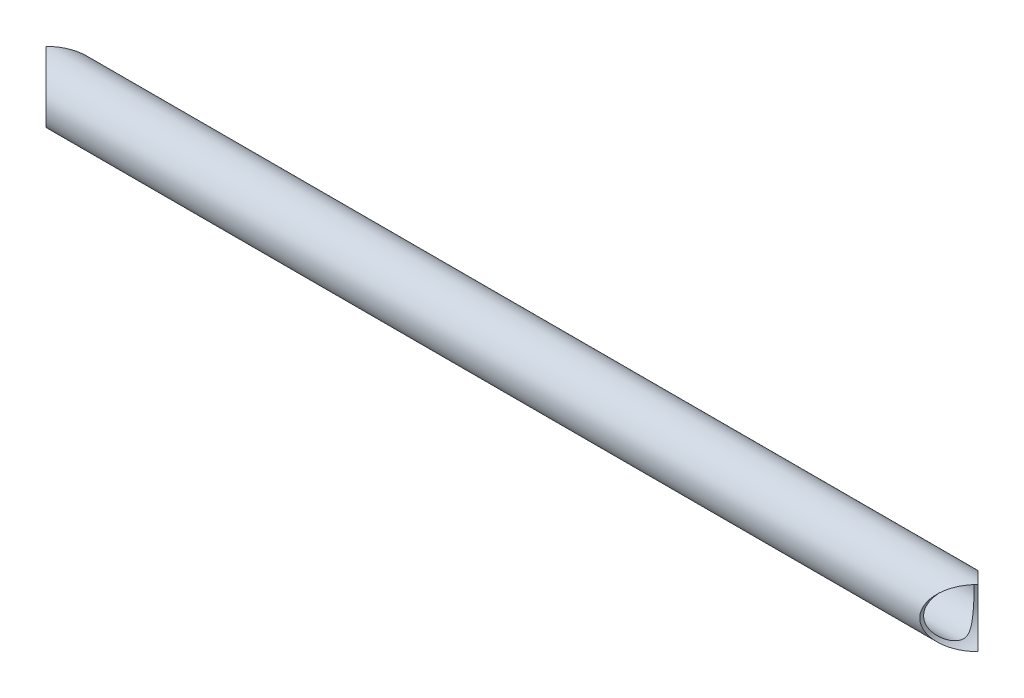
ISO-10303-21;
HEADER;
FILE_DESCRIPTION(('STEP AP214'),'2;1');
FILE_NAME('part.step','',(''),(''),'','','');
FILE_SCHEMA(('AUTOMOTIVE_DESIGN { 1 0 10303 214 1 1 1 1 }'));
ENDSEC;
DATA;
#1=APPLICATION_CONTEXT('core data for automotive mechanical design processes');
#2=APPLICATION_PROTOCOL_DEFINITION('international standard','automotive_design',2000,#1);
#3=PRODUCT_CONTEXT('',#1,'mechanical');
#4=PRODUCT('Part','Part','',(#3));
#5=PRODUCT_RELATED_PRODUCT_CATEGORY('part','',(#4));
#6=PRODUCT_DEFINITION_FORMATION('','',#4);
#7=PRODUCT_DEFINITION_CONTEXT('part definition',#1,'design');
#8=PRODUCT_DEFINITION('design','',#6,#7);
#9=PRODUCT_DEFINITION_SHAPE('','',#8);
#10=(LENGTH_UNIT() NAMED_UNIT(*) SI_UNIT(.MILLI.,.METRE.));
#11=(NAMED_UNIT(*) PLANE_ANGLE_UNIT() SI_UNIT($,.RADIAN.));
#12=(NAMED_UNIT(*) SI_UNIT($,.STERADIAN.) SOLID_ANGLE_UNIT());
#13=UNCERTAINTY_MEASURE_WITH_UNIT(LENGTH_MEASURE(1.E-05),#10,'distance_accuracy_value','');
#14=(GEOMETRIC_REPRESENTATION_CONTEXT(3) GLOBAL_UNCERTAINTY_ASSIGNED_CONTEXT((#13)) GLOBAL_UNIT_ASSIGNED_CONTEXT((#10,
#11,#12)) REPRESENTATION_CONTEXT('',''));
#15=CARTESIAN_POINT('',(0.,0.,0.));
#16=DIRECTION('',(0.,0.,1.));
#17=DIRECTION('',(1.,0.,0.));
#18=AXIS2_PLACEMENT_3D('',#15,#16,#17);
#19=CARTESIAN_POINT('',(-152.4,228.6,-238.125));
#20=DIRECTION('',(0.,0.,1.));
#21=DIRECTION('',(1.,0.,0.));
#22=AXIS2_PLACEMENT_3D('',#19,#20,#21);
#23=CYLINDRICAL_SURFACE('',#22,9.52499999999999);
#24=CARTESIAN_POINT('',(-152.4,228.6,-101.6));
#25=DIRECTION('',(0.707106781186547,0.,0.707106781186547));
#26=DIRECTION('',(0.707106781186547,0.,-0.707106781186547));
#27=AXIS2_PLACEMENT_3D('',#24,#25,#26);
#28=ELLIPSE('',#27,13.4703841816037,9.525);
#29=CARTESIAN_POINT('',(-152.4,238.125,-101.6));
#30=VERTEX_POINT('',#29);
#31=CARTESIAN_POINT('',(-152.4,219.075,-101.6));
#32=VERTEX_POINT('',#31);
#33=EDGE_CURVE('E47',#30,#32,#28,.F.);
#34=ORIENTED_EDGE('',*,*,#33,.T.);
#35=CARTESIAN_POINT('',(-152.4,228.6,-101.6));
#36=DIRECTION('',(0.707106781186547,0.,-0.707106781186547));
#37=DIRECTION('',(0.707106781186547,0.,0.707106781186547));
#38=AXIS2_PLACEMENT_3D('',#35,#36,#37);
#39=ELLIPSE('',#38,13.4703841816037,9.525);
#40=EDGE_CURVE('E57',#32,#30,#39,.F.);
#41=ORIENTED_EDGE('',*,*,#40,.T.);
#42=EDGE_LOOP('',(#34,#41));
#43=FACE_BOUND('',#42,.T.);
#44=CARTESIAN_POINT('',(-142.875,228.6,-109.855));
#45=CARTESIAN_POINT('',(-142.87500085137,228.406250866017,-109.854999130974));
#46=CARTESIAN_POINT('',(-142.880923976125,228.212489304632,-109.848166780821));
#47=CARTESIAN_POINT('',(-142.904480069302,227.826631422453,-109.820969787789));
#48=CARTESIAN_POINT('',(-142.922114069863,227.634535249952,-109.800603952137));
#49=CARTESIAN_POINT('',(-142.968700531082,227.253494245892,-109.74671669801));
#50=CARTESIAN_POINT('',(-142.997658993398,227.064551140828,-109.7131883037));
#51=CARTESIAN_POINT('',(-143.06626573945,226.691325809148,-109.633579683001));
#52=CARTESIAN_POINT('',(-143.105914030754,226.507043585832,-109.587499447726));
#53=CARTESIAN_POINT('',(-143.194816129542,226.145482745751,-109.483876820132));
#54=CARTESIAN_POINT('',(-143.244006461934,225.968166681786,-109.42641012091));
#55=CARTESIAN_POINT('',(-143.351288626491,225.620129557817,-109.300626973059));
#56=CARTESIAN_POINT('',(-143.409384351749,225.44941142324,-109.232305778788));
#57=CARTESIAN_POINT('',(-143.533513866231,225.115348117664,-109.08568628537));
#58=CARTESIAN_POINT('',(-143.599546793716,224.952002148917,-109.007389069259));
#59=CARTESIAN_POINT('',(-143.738608516535,224.633112425986,-108.841625230969));
#60=CARTESIAN_POINT('',(-143.811638843562,224.477570391447,-108.75415660082));
#61=CARTESIAN_POINT('',(-143.992942230831,224.116475044909,-108.535636063504));
#62=CARTESIAN_POINT('',(-144.103987372303,223.91462757172,-108.400737315239));
#63=CARTESIAN_POINT('',(-144.335256151997,223.526881378591,-108.116617995095));
#64=CARTESIAN_POINT('',(-144.455483046478,223.340988366918,-107.967392337387));
#65=CARTESIAN_POINT('',(-144.703057246966,222.984857023593,-107.655685455599));
#66=CARTESIAN_POINT('',(-144.83042068778,222.814656672967,-107.493173779029));
#67=CARTESIAN_POINT('',(-145.089672364822,222.490349874275,-107.156246763394));
#68=CARTESIAN_POINT('',(-145.221559996968,222.336241288616,-106.981833010476));
#69=CARTESIAN_POINT('',(-145.490268739031,222.040890582044,-106.617887041554));
#70=CARTESIAN_POINT('',(-145.627135289796,221.899986610464,-106.428114257642));
#71=CARTESIAN_POINT('',(-145.900277029826,221.634695381101,-106.036829549169));
#72=CARTESIAN_POINT('',(-146.036552013629,221.510313477172,-105.83531384969));
#73=CARTESIAN_POINT('',(-146.304688635106,221.278516699451,-105.420633298704));
#74=CARTESIAN_POINT('',(-146.436558723786,221.171067666948,-105.207493098286));
#75=CARTESIAN_POINT('',(-146.691442369474,220.973470149248,-104.768431819703));
#76=CARTESIAN_POINT('',(-146.81446287908,220.883307987932,-104.542521029458));
#77=CARTESIAN_POINT('',(-147.050125579428,220.717996418519,-104.066814429983));
#78=CARTESIAN_POINT('',(-147.162117857019,220.643633336703,-103.816414669167));
#79=CARTESIAN_POINT('',(-147.358880568049,220.517519256837,-103.299638917286));
#80=CARTESIAN_POINT('',(-147.443709065653,220.465719940797,-103.033298467592));
#81=CARTESIAN_POINT('',(-147.536097566616,220.410426737364,-102.643940845343));
#82=CARTESIAN_POINT('',(-147.560081572859,220.396260607156,-102.526240140689));
#83=CARTESIAN_POINT('',(-147.599826557136,220.372941215349,-102.288990887447));
#84=CARTESIAN_POINT('',(-147.615591423194,220.363785583455,-102.169443240154));
#85=CARTESIAN_POINT('',(-147.638195926769,220.350695800613,-101.929320339337));
#86=CARTESIAN_POINT('',(-147.645043337139,220.346757102303,-101.808746073072));
#87=CARTESIAN_POINT('',(-147.649515298126,220.344182219285,-101.567366153929));
#88=CARTESIAN_POINT('',(-147.647139751201,220.345546090658,-101.446560498618));
#89=CARTESIAN_POINT('',(-147.633287188579,220.353537911924,-101.205834453977));
#90=CARTESIAN_POINT('',(-147.621823920942,220.360157910279,-101.085913003378));
#91=CARTESIAN_POINT('',(-147.590347526087,220.378492094755,-100.847573528745));
#92=CARTESIAN_POINT('',(-147.570330763999,220.390208446644,-100.72915616594));
#93=CARTESIAN_POINT('',(-147.498589799333,220.432691819621,-100.376893975858));
#94=CARTESIAN_POINT('',(-147.435188530354,220.47078599086,-100.146237071126));
#95=CARTESIAN_POINT('',(-147.298694955178,220.555900672935,-99.7362927241506));
#96=CARTESIAN_POINT('',(-147.229283916365,220.60016196055,-99.5551200338247));
#97=CARTESIAN_POINT('',(-147.079042683176,220.699294360388,-99.2004665430093));
#98=CARTESIAN_POINT('',(-146.998204624502,220.754172789204,-99.0269911488941));
#99=CARTESIAN_POINT('',(-146.828240047895,220.87394281657,-98.6869795992413));
#100=CARTESIAN_POINT('',(-146.739085754094,220.938868485421,-98.5204695993091));
#101=CARTESIAN_POINT('',(-146.555384272125,221.078072533404,-98.1945616282065));
#102=CARTESIAN_POINT('',(-146.460837695236,221.152349853565,-98.035162854532));
#103=CARTESIAN_POINT('',(-146.217533604388,221.351633994807,-97.6404902495467));
#104=CARTESIAN_POINT('',(-146.066534072351,221.482704521305,-97.4096393817731));
#105=CARTESIAN_POINT('',(-145.762225101465,221.765614163585,-96.962524617294));
#106=CARTESIAN_POINT('',(-145.608914543225,221.917463651808,-96.746268086802));
#107=CARTESIAN_POINT('',(-145.304431641632,222.241702561116,-96.3286761462399));
#108=CARTESIAN_POINT('',(-145.153256847605,222.414065861768,-96.127322279545));
#109=CARTESIAN_POINT('',(-144.856523823392,222.779606131111,-95.7400616136068));
#110=CARTESIAN_POINT('',(-144.710963114576,222.972773768413,-95.5541479546798));
#111=CARTESIAN_POINT('',(-144.462698797748,223.33119127101,-95.2417910636064));
#112=CARTESIAN_POINT('',(-144.358090176679,223.492023598625,-95.1117795826543));
#113=CARTESIAN_POINT('',(-144.155601927927,223.825736010478,-94.8624340565053));
#114=CARTESIAN_POINT('',(-144.057720826399,223.998613439092,-94.7430976709017));
#115=CARTESIAN_POINT('',(-143.870359334607,224.356002397327,-94.5163399634888));
#116=CARTESIAN_POINT('',(-143.780868875253,224.540499526382,-94.4089043314715));
#117=CARTESIAN_POINT('',(-143.611787868989,224.920837747688,-94.2070907582165));
#118=CARTESIAN_POINT('',(-143.532195476047,225.116676714618,-94.1127103817458));
#119=CARTESIAN_POINT('',(-143.397688658435,225.483103214577,-93.9539254727978));
#120=CARTESIAN_POINT('',(-143.340902606584,225.651989745095,-93.8871748412764));
#121=CARTESIAN_POINT('',(-143.236041203049,225.996188653914,-93.7642761294147));
#122=CARTESIAN_POINT('',(-143.187964032091,226.171499680925,-93.7081258345755));
#123=CARTESIAN_POINT('',(-143.10137378059,226.527624248783,-93.6072207343836));
#124=CARTESIAN_POINT('',(-143.062857419736,226.708435878407,-93.5624620204508));
#125=CARTESIAN_POINT('',(-142.99611185728,227.074508745958,-93.4850201399113));
#126=CARTESIAN_POINT('',(-142.967882768004,227.259770032446,-93.4523371051585));
#127=CARTESIAN_POINT('',(-142.922193476377,227.634306222712,-93.3994881817187));
#128=CARTESIAN_POINT('',(-142.904785183164,227.823596035695,-93.3793826263627));
#129=CARTESIAN_POINT('',(-142.881337103709,228.20381950668,-93.352310062631));
#130=CARTESIAN_POINT('',(-142.875297343065,228.394753168384,-93.345343083839));
#131=CARTESIAN_POINT('',(-142.87472412799,228.776645314771,-93.3446816904598));
#132=CARTESIAN_POINT('',(-142.880189796571,228.967603796453,-93.3509862642653));
#133=CARTESIAN_POINT('',(-142.902501380858,229.347952184751,-93.3767450743445));
#134=CARTESIAN_POINT('',(-142.91934681187,229.537342157826,-93.396198750563));
#135=CARTESIAN_POINT('',(-142.962336192805,229.898723012674,-93.4459187722398));
#136=CARTESIAN_POINT('',(-142.987674409474,230.070940627884,-93.4752489624016));
#137=CARTESIAN_POINT('',(-143.047291157423,230.411738571797,-93.544388950317));
#138=CARTESIAN_POINT('',(-143.08157267569,230.580317664858,-93.5842022493825));
#139=CARTESIAN_POINT('',(-143.158481542436,230.912806206632,-93.673740561271));
#140=CARTESIAN_POINT('',(-143.201106417521,231.076717022802,-93.7234626367097));
#141=CARTESIAN_POINT('',(-143.294060632431,231.399227506909,-93.8322249997312));
#142=CARTESIAN_POINT('',(-143.344392844517,231.557825167848,-93.8912687614435));
#143=CARTESIAN_POINT('',(-143.456253247045,231.881239112751,-94.022974848676));
#144=CARTESIAN_POINT('',(-143.518349023612,232.045572644807,-94.096340886794));
#145=CARTESIAN_POINT('',(-143.64974919785,232.366815288716,-94.2523440091093));
#146=CARTESIAN_POINT('',(-143.719056432078,232.523721443506,-94.3349847424298));
#147=CARTESIAN_POINT('',(-143.936469748638,232.982783680093,-94.5957141072836));
#148=CARTESIAN_POINT('',(-144.094085643406,233.273334821802,-94.7866311500132));
#149=CARTESIAN_POINT('',(-144.386795384043,233.754931306402,-95.1471672195281));
#150=CARTESIAN_POINT('',(-144.518072006197,233.95301288062,-95.3107106505702));
#151=CARTESIAN_POINT('',(-144.788096265142,234.330473861314,-95.6526059082699));
#152=CARTESIAN_POINT('',(-144.926844378882,234.509852071695,-95.8309586806876));
#153=CARTESIAN_POINT('',(-145.209205633139,234.850372890798,-96.201721613324));
#154=CARTESIAN_POINT('',(-145.352829852161,235.011469781996,-96.3941651184609));
#155=CARTESIAN_POINT('',(-145.641483857342,235.315050172218,-96.7921155975218));
#156=CARTESIAN_POINT('',(-145.786513199098,235.457539362408,-96.9976185484917));
#157=CARTESIAN_POINT('',(-146.044840743108,235.696611503452,-97.3782997784627));
#158=CARTESIAN_POINT('',(-146.158549640075,235.796617427103,-97.5510596552251));
#159=CARTESIAN_POINT('',(-146.382312464771,235.984741839882,-97.9052937918285));
#160=CARTESIAN_POINT('',(-146.492365718185,236.072858144948,-98.0867696444704));
#161=CARTESIAN_POINT('',(-146.705590868976,236.236578933631,-98.4585319022405));
#162=CARTESIAN_POINT('',(-146.80877963104,236.312214812114,-98.6487946098));
#163=CARTESIAN_POINT('',(-147.004599732918,236.450454207426,-99.039088469596));
#164=CARTESIAN_POINT('',(-147.097238506192,236.513066926325,-99.2391126002503));
#165=CARTESIAN_POINT('',(-147.280539028389,236.633093878315,-99.6828989038143));
#166=CARTESIAN_POINT('',(-147.368486554437,236.688052450932,-99.9285215602658));
#167=CARTESIAN_POINT('',(-147.476624086336,236.754004837994,-100.306339204585));
#168=CARTESIAN_POINT('',(-147.508691291353,236.773233391453,-100.43374642192));
#169=CARTESIAN_POINT('',(-147.56361192475,236.805851299184,-100.691239187818));
#170=CARTESIAN_POINT('',(-147.586470306333,236.819243792849,-100.821323256882));
#171=CARTESIAN_POINT('',(-147.62206810894,236.839989631339,-101.084946705684));
#172=CARTESIAN_POINT('',(-147.634684394664,236.84726952223,-101.218508764674));
#173=CARTESIAN_POINT('',(-147.648619874186,236.855306107447,-101.486417919941));
#174=CARTESIAN_POINT('',(-147.649939911573,236.85606328888,-101.620764956847));
#175=CARTESIAN_POINT('',(-147.641202324923,236.851029854125,-101.889034938598));
#176=CARTESIAN_POINT('',(-147.631138307579,236.845235558614,-102.02295760274));
#177=CARTESIAN_POINT('',(-147.600209848149,236.827268862574,-102.289111683742));
#178=CARTESIAN_POINT('',(-147.579343623203,236.815095409186,-102.421342817729));
#179=CARTESIAN_POINT('',(-147.523697580561,236.782206595522,-102.704546430064));
#180=CARTESIAN_POINT('',(-147.487202723969,236.760421364586,-102.855055287897));
#181=CARTESIAN_POINT('',(-147.403191155665,236.709250007172,-103.151703252687));
#182=CARTESIAN_POINT('',(-147.355665479551,236.67985769641,-103.297838695869));
#183=CARTESIAN_POINT('',(-147.251644772577,236.613978878295,-103.585709123146));
#184=CARTESIAN_POINT('',(-147.19512334772,236.577471421659,-103.727429643092));
#185=CARTESIAN_POINT('',(-147.07520407736,236.497933942537,-104.005958110791));
#186=CARTESIAN_POINT('',(-147.011807777588,236.454905385378,-104.142767153659));
#187=CARTESIAN_POINT('',(-146.832749866028,236.329831049898,-104.507591185681));
#188=CARTESIAN_POINT('',(-146.712045295214,236.241836566895,-104.731104258484));
#189=CARTESIAN_POINT('',(-146.461768069578,236.049031016719,-105.165597586059));
#190=CARTESIAN_POINT('',(-146.332189369989,235.944208420122,-105.376569111478));
#191=CARTESIAN_POINT('',(-146.068538777804,235.718175810107,-105.7870696561));
#192=CARTESIAN_POINT('',(-145.934460864055,235.596943119533,-105.98658228698));
#193=CARTESIAN_POINT('',(-145.665453567415,235.338421490995,-106.374196011052));
#194=CARTESIAN_POINT('',(-145.530524401609,235.201136501598,-106.562299893368));
#195=CARTESIAN_POINT('',(-145.254370347392,234.901555904191,-106.938225874476));
#196=CARTESIAN_POINT('',(-145.113264475866,234.738244688045,-107.125328601192));
#197=CARTESIAN_POINT('',(-144.836105671408,234.39328048647,-107.48601693765));
#198=CARTESIAN_POINT('',(-144.70005372929,234.211623930162,-107.65959990411));
#199=CARTESIAN_POINT('',(-144.436140711227,233.830317575679,-107.99160103031));
#200=CARTESIAN_POINT('',(-144.30826219629,233.63070843393,-108.150051859642));
#201=CARTESIAN_POINT('',(-144.063250623786,233.21332127486,-108.450425409072));
#202=CARTESIAN_POINT('',(-143.946112658529,232.995551643368,-108.592355685993));
#203=CARTESIAN_POINT('',(-143.757591966555,232.608288566503,-108.818956087031));
#204=CARTESIAN_POINT('',(-143.682805017896,232.443156845253,-108.90828007273));
#205=CARTESIAN_POINT('',(-143.54120930788,232.104443279242,-109.07660654907));
#206=CARTESIAN_POINT('',(-143.474398582611,231.930863529438,-109.155611580905));
#207=CARTESIAN_POINT('',(-143.349896757306,231.576001146484,-109.302289914397));
#208=CARTESIAN_POINT('',(-143.292197695421,231.394725415898,-109.369973112269));
#209=CARTESIAN_POINT('',(-143.186917126928,231.025204306969,-109.493118335221));
#210=CARTESIAN_POINT('',(-143.139334511082,230.836959695404,-109.548581700195));
#211=CARTESIAN_POINT('',(-143.061127906438,230.481346233512,-109.639551741935));
#212=CARTESIAN_POINT('',(-143.029064178173,230.314728334993,-109.676763022143));
#213=CARTESIAN_POINT('',(-142.973668033218,229.978041246021,-109.740970368102));
#214=CARTESIAN_POINT('',(-142.950338057636,229.807971104638,-109.767963577899));
#215=CARTESIAN_POINT('',(-142.912838905101,229.465488145167,-109.811318052968));
#216=CARTESIAN_POINT('',(-142.89866900201,229.293075513879,-109.82768016099));
#217=CARTESIAN_POINT('',(-142.879750865947,228.947111623887,-109.849519562262));
#218=CARTESIAN_POINT('',(-142.874999237341,228.773560798195,-109.855000778475));
#219=CARTESIAN_POINT('',(-142.875,228.6,-109.855));
#220=B_SPLINE_CURVE_WITH_KNOTS('',3,(#44,#45,#46,#47,#48,#49,#50,#51,#52,#53,#54,#55,#56,#57,
#58,#59,#60,#61,#62,#63,#64,#65,#66,#67,#68,#69,#70,#71,#72,#73,#74,#75,#76,#77,#78,#79,#80,#81,
#82,#83,#84,#85,#86,#87,#88,#89,#90,#91,#92,#93,#94,#95,#96,#97,#98,#99,#100,#101,#102,#103,
#104,#105,#106,#107,#108,#109,#110,#111,#112,#113,#114,#115,#116,#117,#118,#119,#120,#121,#122,
#123,#124,#125,#126,#127,#128,#129,#130,#131,#132,#133,#134,#135,#136,#137,#138,#139,#140,#141,
#142,#143,#144,#145,#146,#147,#148,#149,#150,#151,#152,#153,#154,#155,#156,#157,#158,#159,#160,
#161,#162,#163,#164,#165,#166,#167,#168,#169,#170,#171,#172,#173,#174,#175,#176,#177,#178,#179,
#180,#181,#182,#183,#184,#185,#186,#187,#188,#189,#190,#191,#192,#193,#194,#195,#196,#197,#198,
#199,#200,#201,#202,#203,#204,#205,#206,#207,#208,#209,#210,#211,#212,#213,#214,#215,#216,#217,
#218,#219),.UNSPECIFIED.,.T.,.F.,(4,2,2,2,2,2,2,2,2,2,2,2,2,2,2,2,2,2,2,2,2,2,2,2,2,2,2,2,2,2,2,
2,2,2,2,2,2,2,2,2,2,2,2,2,2,2,2,2,2,2,2,2,2,2,2,2,2,2,2,2,2,2,2,2,2,2,2,2,2,2,2,2,2,2,2,2,2,2,2,
2,2,2,2,2,2,2,2,4),(0.,0.581060302241175,1.16217182303355,1.74359173542285,2.32501205943971,
2.90268969124202,3.48062058537874,4.05848879048122,4.63648377810276,5.43621695420247,
6.23623508026257,7.03814127970883,7.83994081992864,8.65857780584579,9.47747942119571,
10.2947073130676,11.1112859813718,11.9620431912297,12.8109695269324,13.1734956172863,
13.5358500604876,13.8978884475343,14.2599306635729,14.6214262186982,14.9830755469358,
15.7069631447091,16.3031815010826,16.8998122025499,17.4985123074859,18.0971446771323,
19.0121600805804,19.9276339189251,20.8419543021521,21.7558662790184,22.4505614625091,
23.1451039659047,23.8388020282264,24.5323705181271,25.1026275067059,25.6727652316906,
26.2427070714556,26.8126551342036,27.3853166471828,27.9579794496037,28.5305986031097,
29.1031933687764,29.6321866176356,30.1613567724987,30.6903702914557,31.2195814376324,
31.7901536941553,32.3609512342489,33.5023725912857,34.3667872613036,35.2312571774337,
36.0978433977629,36.9641639487797,37.6529096955541,38.341781789667,39.0288936791848,
39.715518398605,40.5125737663151,40.9105237639805,41.3082594272077,41.7107088469782,
42.1131282121322,42.5157736890733,42.918485642225,43.38692566356,43.8557477127696,
44.32597156752,44.7960899166667,45.6013224389748,46.4071090223581,47.2140207141776,
48.0207343366109,48.8767355197428,49.7329036438819,50.5871794481831,51.441062941544,
52.0468024868874,52.6523925776822,53.2574505352096,53.862442115674,54.3830405578492,
54.9037844002805,55.4244869572119,55.9450017475653),.UNSPECIFIED.);
#221=CARTESIAN_POINT('',(-142.875,228.6,-109.855));
#222=VERTEX_POINT('',#221);
#223=EDGE_CURVE('E64',#222,#222,#220,.T.);
#224=ORIENTED_EDGE('',*,*,#223,.F.);
#225=EDGE_LOOP('',(#224));
#226=FACE_BOUND('',#225,.T.);
#227=ADVANCED_FACE('F33',(#43,#226),#23,.F.);
#228=CARTESIAN_POINT('',(152.4,228.6,-238.125));
#229=DIRECTION('',(0.,0.,1.));
#230=DIRECTION('',(1.,0.,0.));
#231=AXIS2_PLACEMENT_3D('',#228,#229,#230);
#232=CYLINDRICAL_SURFACE('',#231,9.52499999999999);
#233=CARTESIAN_POINT('',(152.4,228.6,-101.6));
#234=DIRECTION('',(0.707106781186547,0.,0.707106781186547));
#235=DIRECTION('',(0.707106781186547,0.,-0.707106781186547));
#236=AXIS2_PLACEMENT_3D('',#233,#234,#235);
#237=ELLIPSE('',#236,13.4703841816037,9.525);
#238=CARTESIAN_POINT('',(152.4,238.125,-101.6));
#239=VERTEX_POINT('',#238);
#240=CARTESIAN_POINT('',(152.4,219.075,-101.6));
#241=VERTEX_POINT('',#240);
#242=EDGE_CURVE('E11',#239,#241,#237,.T.);
#243=ORIENTED_EDGE('',*,*,#242,.T.);
#244=CARTESIAN_POINT('',(152.4,228.6,-101.6));
#245=DIRECTION('',(0.707106781186547,0.,-0.707106781186547));
#246=DIRECTION('',(0.707106781186547,0.,0.707106781186547));
#247=AXIS2_PLACEMENT_3D('',#244,#245,#246);
#248=ELLIPSE('',#247,13.4703841816037,9.525);
#249=EDGE_CURVE('E41',#241,#239,#248,.T.);
#250=ORIENTED_EDGE('',*,*,#249,.T.);
#251=EDGE_LOOP('',(#243,#250));
#252=FACE_BOUND('',#251,.T.);
#253=CARTESIAN_POINT('',(142.875,228.6,-93.345));
#254=CARTESIAN_POINT('',(142.87500085137,228.406250866017,-93.3450008690264));
#255=CARTESIAN_POINT('',(142.880923976125,228.212489304632,-93.3518332191793));
#256=CARTESIAN_POINT('',(142.904480069302,227.826631422453,-93.3790302122109));
#257=CARTESIAN_POINT('',(142.922114069863,227.634535249952,-93.3993960478634));
#258=CARTESIAN_POINT('',(142.968700531082,227.253494245892,-93.4532833019904));
#259=CARTESIAN_POINT('',(142.997658993398,227.064551140828,-93.4868116962998));
#260=CARTESIAN_POINT('',(143.06626573945,226.691325809148,-93.5664203169986));
#261=CARTESIAN_POINT('',(143.105914030754,226.507043585832,-93.6125005522743));
#262=CARTESIAN_POINT('',(143.194816129542,226.145482745751,-93.716123179868));
#263=CARTESIAN_POINT('',(143.244006461934,225.968166681786,-93.7735898790905));
#264=CARTESIAN_POINT('',(143.351288626491,225.620129557817,-93.8993730269408));
#265=CARTESIAN_POINT('',(143.409384351749,225.44941142324,-93.9676942212121));
#266=CARTESIAN_POINT('',(143.533513866231,225.115348117664,-94.1143137146301));
#267=CARTESIAN_POINT('',(143.599546793716,224.952002148917,-94.1926109307414));
#268=CARTESIAN_POINT('',(143.738608516535,224.633112425986,-94.3583747690309));
#269=CARTESIAN_POINT('',(143.811638843562,224.477570391447,-94.4458433991799));
#270=CARTESIAN_POINT('',(143.992942230831,224.116475044909,-94.6643639364956));
#271=CARTESIAN_POINT('',(144.103987372303,223.91462757172,-94.7992626847607));
#272=CARTESIAN_POINT('',(144.335256151997,223.526881378591,-95.0833820049045));
#273=CARTESIAN_POINT('',(144.455483046478,223.340988366918,-95.2326076626131));
#274=CARTESIAN_POINT('',(144.703057246966,222.984857023593,-95.5443145444013));
#275=CARTESIAN_POINT('',(144.83042068778,222.814656672967,-95.7068262209706));
#276=CARTESIAN_POINT('',(145.089672364822,222.490349874275,-96.0437532366055));
#277=CARTESIAN_POINT('',(145.221559996968,222.336241288616,-96.2181669895244));
#278=CARTESIAN_POINT('',(145.490268739031,222.040890582044,-96.5821129584457));
#279=CARTESIAN_POINT('',(145.627135289796,221.899986610464,-96.7718857423579));
#280=CARTESIAN_POINT('',(145.900277029826,221.634695381101,-97.1631704508306));
#281=CARTESIAN_POINT('',(146.036552013629,221.510313477172,-97.3646861503101));
#282=CARTESIAN_POINT('',(146.304688635106,221.278516699451,-97.7793667012964));
#283=CARTESIAN_POINT('',(146.436558723786,221.171067666948,-97.9925069017138));
#284=CARTESIAN_POINT('',(146.691442369474,220.973470149248,-98.4315681802966));
#285=CARTESIAN_POINT('',(146.81446287908,220.883307987932,-98.6574789705415));
#286=CARTESIAN_POINT('',(147.050125579428,220.717996418519,-99.1331855700168));
#287=CARTESIAN_POINT('',(147.162117857019,220.643633336703,-99.3835853308334));
#288=CARTESIAN_POINT('',(147.358880568049,220.517519256837,-99.9003610827135));
#289=CARTESIAN_POINT('',(147.443709065653,220.465719940797,-100.166701532407));
#290=CARTESIAN_POINT('',(147.536097566616,220.410426737364,-100.556059154657));
#291=CARTESIAN_POINT('',(147.560081572859,220.396260607156,-100.673759859311));
#292=CARTESIAN_POINT('',(147.599826557136,220.372941215349,-100.911009112553));
#293=CARTESIAN_POINT('',(147.615591423194,220.363785583455,-101.030556759846));
#294=CARTESIAN_POINT('',(147.638195926769,220.350695800613,-101.270679660663));
#295=CARTESIAN_POINT('',(147.645043337139,220.346757102303,-101.391253926928));
#296=CARTESIAN_POINT('',(147.649515298126,220.344182219285,-101.632633846071));
#297=CARTESIAN_POINT('',(147.647139751201,220.345546090658,-101.753439501382));
#298=CARTESIAN_POINT('',(147.633287188579,220.353537911924,-101.994165546023));
#299=CARTESIAN_POINT('',(147.621823920942,220.360157910279,-102.114086996622));
#300=CARTESIAN_POINT('',(147.590347526087,220.378492094755,-102.352426471255));
#301=CARTESIAN_POINT('',(147.570330763999,220.390208446644,-102.47084383406));
#302=CARTESIAN_POINT('',(147.498589799333,220.432691819621,-102.823106024142));
#303=CARTESIAN_POINT('',(147.435188530354,220.47078599086,-103.053762928874));
#304=CARTESIAN_POINT('',(147.298694955178,220.555900672935,-103.463707275849));
#305=CARTESIAN_POINT('',(147.229283916365,220.60016196055,-103.644879966175));
#306=CARTESIAN_POINT('',(147.079042683176,220.699294360388,-103.999533456991));
#307=CARTESIAN_POINT('',(146.998204624502,220.754172789204,-104.173008851106));
#308=CARTESIAN_POINT('',(146.828240047895,220.87394281657,-104.513020400759));
#309=CARTESIAN_POINT('',(146.739085754094,220.938868485421,-104.679530400691));
#310=CARTESIAN_POINT('',(146.555384272125,221.078072533404,-105.005438371793));
#311=CARTESIAN_POINT('',(146.460837695236,221.152349853565,-105.164837145468));
#312=CARTESIAN_POINT('',(146.217533604388,221.351633994807,-105.559509750453));
#313=CARTESIAN_POINT('',(146.066534072351,221.482704521305,-105.790360618227));
#314=CARTESIAN_POINT('',(145.762225101465,221.765614163585,-106.237475382706));
#315=CARTESIAN_POINT('',(145.608914543225,221.917463651808,-106.453731913198));
#316=CARTESIAN_POINT('',(145.304431641632,222.241702561116,-106.87132385376));
#317=CARTESIAN_POINT('',(145.153256847606,222.414065861768,-107.072677720455));
#318=CARTESIAN_POINT('',(144.856523823392,222.779606131111,-107.459938386393));
#319=CARTESIAN_POINT('',(144.710963114576,222.972773768413,-107.64585204532));
#320=CARTESIAN_POINT('',(144.462698797748,223.33119127101,-107.958208936394));
#321=CARTESIAN_POINT('',(144.358090176679,223.492023598625,-108.088220417346));
#322=CARTESIAN_POINT('',(144.155601927927,223.825736010478,-108.337565943495));
#323=CARTESIAN_POINT('',(144.057720826399,223.998613439092,-108.456902329098));
#324=CARTESIAN_POINT('',(143.870359334607,224.356002397327,-108.683660036511));
#325=CARTESIAN_POINT('',(143.780868875253,224.540499526382,-108.791095668528));
#326=CARTESIAN_POINT('',(143.61178786899,224.920837747688,-108.992909241783));
#327=CARTESIAN_POINT('',(143.532195476047,225.116676714618,-109.087289618254));
#328=CARTESIAN_POINT('',(143.397688658435,225.483103214577,-109.246074527202));
#329=CARTESIAN_POINT('',(143.340902606584,225.651989745095,-109.312825158724));
#330=CARTESIAN_POINT('',(143.236041203049,225.996188653914,-109.435723870585));
#331=CARTESIAN_POINT('',(143.187964032091,226.171499680925,-109.491874165424));
#332=CARTESIAN_POINT('',(143.10137378059,226.527624248783,-109.592779265616));
#333=CARTESIAN_POINT('',(143.062857419736,226.708435878407,-109.637537979549));
#334=CARTESIAN_POINT('',(142.99611185728,227.074508745958,-109.714979860089));
#335=CARTESIAN_POINT('',(142.967882768005,227.259770032446,-109.747662894841));
#336=CARTESIAN_POINT('',(142.922193476377,227.634306222712,-109.800511818281));
#337=CARTESIAN_POINT('',(142.904785183164,227.823596035695,-109.820617373637));
#338=CARTESIAN_POINT('',(142.881337103709,228.20381950668,-109.847689937369));
#339=CARTESIAN_POINT('',(142.875297343066,228.394753168384,-109.854656916161));
#340=CARTESIAN_POINT('',(142.87472412799,228.776645314771,-109.85531830954));
#341=CARTESIAN_POINT('',(142.880189796571,228.967603796453,-109.849013735735));
#342=CARTESIAN_POINT('',(142.902501380858,229.347952184751,-109.823254925655));
#343=CARTESIAN_POINT('',(142.91934681187,229.537342157826,-109.803801249437));
#344=CARTESIAN_POINT('',(142.962336192805,229.898723012674,-109.75408122776));
#345=CARTESIAN_POINT('',(142.987674409474,230.070940627884,-109.724751037598));
#346=CARTESIAN_POINT('',(143.047291157423,230.411738571797,-109.655611049683));
#347=CARTESIAN_POINT('',(143.08157267569,230.580317664858,-109.615797750618));
#348=CARTESIAN_POINT('',(143.158481542436,230.912806206632,-109.526259438729));
#349=CARTESIAN_POINT('',(143.201106417521,231.076717022802,-109.47653736329));
#350=CARTESIAN_POINT('',(143.294060632431,231.399227506909,-109.367775000269));
#351=CARTESIAN_POINT('',(143.344392844517,231.557825167848,-109.308731238557));
#352=CARTESIAN_POINT('',(143.456253247045,231.881239112751,-109.177025151324));
#353=CARTESIAN_POINT('',(143.518349023612,232.045572644807,-109.103659113206));
#354=CARTESIAN_POINT('',(143.64974919785,232.366815288716,-108.947655990891));
#355=CARTESIAN_POINT('',(143.719056432078,232.523721443506,-108.86501525757));
#356=CARTESIAN_POINT('',(143.936469748638,232.982783680093,-108.604285892716));
#357=CARTESIAN_POINT('',(144.094085643406,233.273334821802,-108.413368849987));
#358=CARTESIAN_POINT('',(144.386795384044,233.754931306402,-108.052832780472));
#359=CARTESIAN_POINT('',(144.518072006197,233.95301288062,-107.88928934943));
#360=CARTESIAN_POINT('',(144.788096265142,234.330473861314,-107.54739409173));
#361=CARTESIAN_POINT('',(144.926844378882,234.509852071695,-107.369041319312));
#362=CARTESIAN_POINT('',(145.209205633139,234.850372890798,-106.998278386676));
#363=CARTESIAN_POINT('',(145.352829852161,235.011469781996,-106.805834881539));
#364=CARTESIAN_POINT('',(145.641483857342,235.315050172218,-106.407884402478));
#365=CARTESIAN_POINT('',(145.786513199098,235.457539362408,-106.202381451508));
#366=CARTESIAN_POINT('',(146.044840743108,235.696611503452,-105.821700221537));
#367=CARTESIAN_POINT('',(146.158549640076,235.796617427103,-105.648940344775));
#368=CARTESIAN_POINT('',(146.382312464771,235.984741839882,-105.294706208171));
#369=CARTESIAN_POINT('',(146.492365718185,236.072858144948,-105.11323035553));
#370=CARTESIAN_POINT('',(146.705590868976,236.236578933631,-104.741468097759));
#371=CARTESIAN_POINT('',(146.80877963104,236.312214812114,-104.5512053902));
#372=CARTESIAN_POINT('',(147.004599732918,236.450454207426,-104.160911530404));
#373=CARTESIAN_POINT('',(147.097238506192,236.513066926325,-103.96088739975));
#374=CARTESIAN_POINT('',(147.280539028389,236.633093878315,-103.517101096186));
#375=CARTESIAN_POINT('',(147.368486554437,236.688052450932,-103.271478439734));
#376=CARTESIAN_POINT('',(147.476624086336,236.754004837994,-102.893660795415));
#377=CARTESIAN_POINT('',(147.508691291353,236.773233391453,-102.76625357808));
#378=CARTESIAN_POINT('',(147.56361192475,236.805851299184,-102.508760812182));
#379=CARTESIAN_POINT('',(147.586470306333,236.819243792849,-102.378676743118));
#380=CARTESIAN_POINT('',(147.62206810894,236.839989631339,-102.115053294316));
#381=CARTESIAN_POINT('',(147.634684394664,236.84726952223,-101.981491235326));
#382=CARTESIAN_POINT('',(147.648619874186,236.855306107447,-101.713582080059));
#383=CARTESIAN_POINT('',(147.649939911573,236.85606328888,-101.579235043153));
#384=CARTESIAN_POINT('',(147.641202324924,236.851029854125,-101.310965061402));
#385=CARTESIAN_POINT('',(147.631138307579,236.845235558614,-101.17704239726));
#386=CARTESIAN_POINT('',(147.600209848149,236.827268862574,-100.910888316258));
#387=CARTESIAN_POINT('',(147.579343623203,236.815095409186,-100.778657182271));
#388=CARTESIAN_POINT('',(147.523697580562,236.782206595522,-100.495453569936));
#389=CARTESIAN_POINT('',(147.487202723969,236.760421364586,-100.344944712103));
#390=CARTESIAN_POINT('',(147.403191155665,236.709250007172,-100.048296747313));
#391=CARTESIAN_POINT('',(147.355665479551,236.67985769641,-99.9021613041312));
#392=CARTESIAN_POINT('',(147.251644772577,236.613978878295,-99.6142908768545));
#393=CARTESIAN_POINT('',(147.19512334772,236.577471421659,-99.4725703569084));
#394=CARTESIAN_POINT('',(147.075204077361,236.497933942537,-99.1940418892089));
#395=CARTESIAN_POINT('',(147.011807777588,236.454905385378,-99.057232846341));
#396=CARTESIAN_POINT('',(146.832749866028,236.329831049898,-98.6924088143194));
#397=CARTESIAN_POINT('',(146.712045295214,236.241836566895,-98.4688957415156));
#398=CARTESIAN_POINT('',(146.461768069578,236.049031016719,-98.0344024139408));
#399=CARTESIAN_POINT('',(146.332189369989,235.944208420122,-97.8234308885215));
#400=CARTESIAN_POINT('',(146.068538777804,235.718175810107,-97.4129303438996));
#401=CARTESIAN_POINT('',(145.934460864055,235.596943119533,-97.21341771302));
#402=CARTESIAN_POINT('',(145.665453567415,235.338421490995,-96.825803988948));
#403=CARTESIAN_POINT('',(145.530524401609,235.201136501598,-96.6377001066324));
#404=CARTESIAN_POINT('',(145.254370347392,234.901555904191,-96.2617741255239));
#405=CARTESIAN_POINT('',(145.113264475866,234.738244688045,-96.074671398808));
#406=CARTESIAN_POINT('',(144.836105671408,234.39328048647,-95.7139830623498));
#407=CARTESIAN_POINT('',(144.70005372929,234.211623930162,-95.5404000958897));
#408=CARTESIAN_POINT('',(144.436140711227,233.830317575679,-95.2083989696898));
#409=CARTESIAN_POINT('',(144.30826219629,233.63070843393,-95.0499481403575));
#410=CARTESIAN_POINT('',(144.063250623787,233.21332127486,-94.7495745909276));
#411=CARTESIAN_POINT('',(143.946112658529,232.995551643368,-94.6076443140066));
#412=CARTESIAN_POINT('',(143.757591966555,232.608288566503,-94.3810439129687));
#413=CARTESIAN_POINT('',(143.682805017897,232.443156845253,-94.2917199272702));
#414=CARTESIAN_POINT('',(143.54120930788,232.104443279242,-94.1233934509296));
#415=CARTESIAN_POINT('',(143.474398582611,231.930863529438,-94.0443884190954));
#416=CARTESIAN_POINT('',(143.349896757306,231.576001146484,-93.8977100856031));
#417=CARTESIAN_POINT('',(143.292197695421,231.394725415898,-93.8300268877312));
#418=CARTESIAN_POINT('',(143.186917126928,231.025204306969,-93.7068816647786));
#419=CARTESIAN_POINT('',(143.139334511082,230.836959695404,-93.6514182998052));
#420=CARTESIAN_POINT('',(143.061127906438,230.481346233512,-93.560448258065));
#421=CARTESIAN_POINT('',(143.029064178173,230.314728334993,-93.5232369778572));
#422=CARTESIAN_POINT('',(142.973668033218,229.978041246021,-93.4590296318976));
#423=CARTESIAN_POINT('',(142.950338057636,229.807971104638,-93.4320364221011));
#424=CARTESIAN_POINT('',(142.912838905102,229.465488145167,-93.3886819470323));
#425=CARTESIAN_POINT('',(142.89866900201,229.293075513879,-93.3723198390101));
#426=CARTESIAN_POINT('',(142.879750865947,228.947111623887,-93.3504804377375));
#427=CARTESIAN_POINT('',(142.874999237341,228.773560798195,-93.3449992215247));
#428=CARTESIAN_POINT('',(142.875,228.6,-93.345));
#429=B_SPLINE_CURVE_WITH_KNOTS('',3,(#253,#254,#255,#256,#257,#258,#259,#260,#261,#262,#263,
#264,#265,#266,#267,#268,#269,#270,#271,#272,#273,#274,#275,#276,#277,#278,#279,#280,#281,#282,
#283,#284,#285,#286,#287,#288,#289,#290,#291,#292,#293,#294,#295,#296,#297,#298,#299,#300,#301,
#302,#303,#304,#305,#306,#307,#308,#309,#310,#311,#312,#313,#314,#315,#316,#317,#318,#319,#320,
#321,#322,#323,#324,#325,#326,#327,#328,#329,#330,#331,#332,#333,#334,#335,#336,#337,#338,#339,
#340,#341,#342,#343,#344,#345,#346,#347,#348,#349,#350,#351,#352,#353,#354,#355,#356,#357,#358,
#359,#360,#361,#362,#363,#364,#365,#366,#367,#368,#369,#370,#371,#372,#373,#374,#375,#376,#377,
#378,#379,#380,#381,#382,#383,#384,#385,#386,#387,#388,#389,#390,#391,#392,#393,#394,#395,#396,
#397,#398,#399,#400,#401,#402,#403,#404,#405,#406,#407,#408,#409,#410,#411,#412,#413,#414,#415,
#416,#417,#418,#419,#420,#421,#422,#423,#424,#425,#426,#427,#428),.UNSPECIFIED.,.T.,.F.,(4,2,2,
2,2,2,2,2,2,2,2,2,2,2,2,2,2,2,2,2,2,2,2,2,2,2,2,2,2,2,2,2,2,2,2,2,2,2,2,2,2,2,2,2,2,2,2,2,2,2,2,
2,2,2,2,2,2,2,2,2,2,2,2,2,2,2,2,2,2,2,2,2,2,2,2,2,2,2,2,2,2,2,2,2,2,2,2,4),(0.,
0.581060302241175,1.16217182303355,1.74359173542285,2.32501205943971,2.90268969124199,
3.48062058537874,4.05848879048121,4.63648377810276,5.43621695420247,6.23623508026257,
7.03814127970882,7.83994081992864,8.65857780584573,9.47747942119566,10.2947073130675,
11.1112859813718,11.9620431912297,12.8109695269324,13.1734956172863,13.5358500604876,
13.8978884475343,14.2599306635729,14.6214262186982,14.9830755469358,15.7069631447091,
16.3031815010826,16.89981220255,17.4985123074859,18.0971446771323,19.0121600805804,
19.9276339189251,20.8419543021521,21.7558662790184,22.4505614625091,23.1451039659047,
23.8388020282264,24.5323705181271,25.1026275067059,25.6727652316906,26.2427070714556,
26.8126551342036,27.3853166471828,27.9579794496037,28.5305986031097,29.1031933687764,
29.6321866176356,30.1613567724987,30.6903702914557,31.2195814376324,31.7901536941553,
32.3609512342489,33.5023725912857,34.3667872613036,35.2312571774337,36.0978433977629,
36.9641639487797,37.6529096955541,38.341781789667,39.0288936791848,39.715518398605,
40.512573766315,40.9105237639805,41.3082594272077,41.7107088469782,42.1131282121322,
42.5157736890733,42.918485642225,43.38692566356,43.8557477127696,44.3259715675199,
44.7960899166667,45.6013224389748,46.4071090223581,47.2140207141776,48.0207343366109,
48.8767355197428,49.732903643882,50.5871794481831,51.441062941544,52.0468024868874,
52.6523925776822,53.2574505352096,53.862442115674,54.3830405578492,54.9037844002805,
55.4244869572119,55.9450017475653),.UNSPECIFIED.);
#430=CARTESIAN_POINT('',(142.875,228.6,-93.345));
#431=VERTEX_POINT('',#430);
#432=EDGE_CURVE('E60',#431,#431,#429,.T.);
#433=ORIENTED_EDGE('',*,*,#432,.F.);
#434=EDGE_LOOP('',(#433));
#435=FACE_BOUND('',#434,.T.);
#436=ADVANCED_FACE('F83',(#252,#435),#232,.F.);
#437=CARTESIAN_POINT('',(-152.4,228.6,-101.6));
#438=DIRECTION('',(1.,0.,0.));
#439=DIRECTION('',(0.,0.,-1.));
#440=AXIS2_PLACEMENT_3D('',#437,#438,#439);
#441=CYLINDRICAL_SURFACE('',#440,9.52500000000001);
#442=ORIENTED_EDGE('',*,*,#242,.F.);
#443=ORIENTED_EDGE('',*,*,#249,.F.);
#444=EDGE_LOOP('',(#442,#443));
#445=FACE_BOUND('',#444,.T.);
#446=ORIENTED_EDGE('',*,*,#33,.F.);
#447=ORIENTED_EDGE('',*,*,#40,.F.);
#448=EDGE_LOOP('',(#446,#447));
#449=FACE_BOUND('',#448,.T.);
#450=ADVANCED_FACE('F35',(#445,#449),#441,.T.);
#451=CARTESIAN_POINT('',(-152.4,228.6,-101.6));
#452=DIRECTION('',(1.,0.,0.));
#453=DIRECTION('',(0.,0.,-1.));
#454=AXIS2_PLACEMENT_3D('',#451,#452,#453);
#455=CYLINDRICAL_SURFACE('',#454,8.25500000000001);
#456=ORIENTED_EDGE('',*,*,#432,.T.);
#457=EDGE_LOOP('',(#456));
#458=FACE_BOUND('',#457,.T.);
#459=ORIENTED_EDGE('',*,*,#223,.T.);
#460=EDGE_LOOP('',(#459));
#461=FACE_BOUND('',#460,.T.);
#462=ADVANCED_FACE('F76',(#458,#461),#455,.F.);
#463=CLOSED_SHELL('',(#227,#436,#450,#462));
#464=MANIFOLD_SOLID_BREP('B2',#463);
#465=ADVANCED_BREP_SHAPE_REPRESENTATION('',(#18,#464),#14);
#466=SHAPE_DEFINITION_REPRESENTATION(#9,#465);
ENDSEC;
END-ISO-10303-21;
